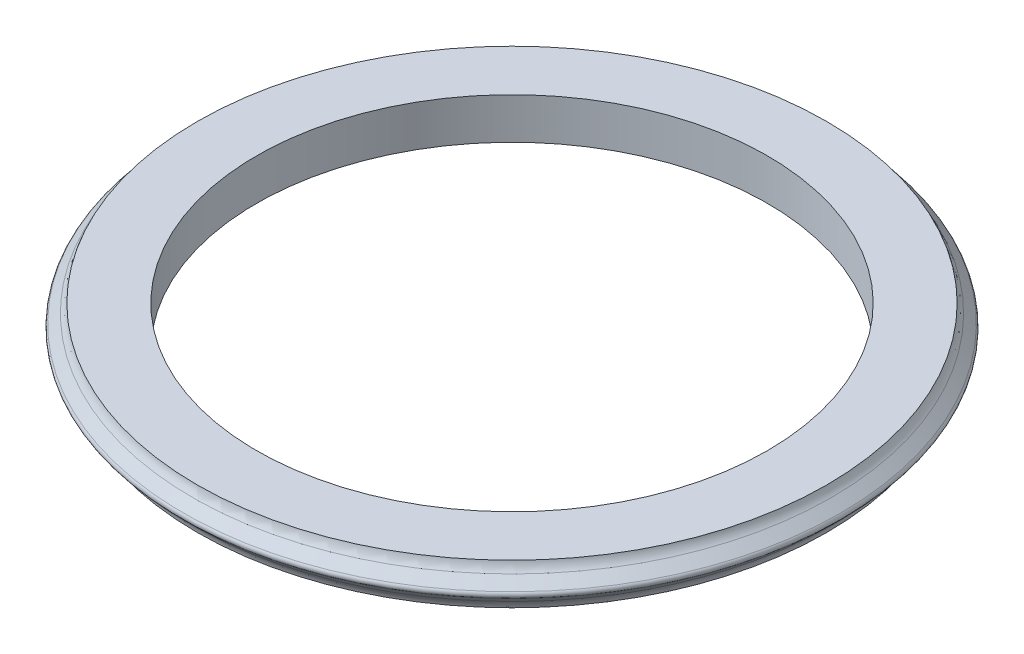
ISO-10303-21;
HEADER;
FILE_DESCRIPTION(('STEP AP214'),'2;1');
FILE_NAME('part.step','',(''),(''),'','','');
FILE_SCHEMA(('AUTOMOTIVE_DESIGN { 1 0 10303 214 1 1 1 1 }'));
ENDSEC;
DATA;
#1=APPLICATION_CONTEXT('core data for automotive mechanical design processes');
#2=APPLICATION_PROTOCOL_DEFINITION('international standard','automotive_design',2000,#1);
#3=PRODUCT_CONTEXT('',#1,'mechanical');
#4=PRODUCT('Part','Part','',(#3));
#5=PRODUCT_RELATED_PRODUCT_CATEGORY('part','',(#4));
#6=PRODUCT_DEFINITION_FORMATION('','',#4);
#7=PRODUCT_DEFINITION_CONTEXT('part definition',#1,'design');
#8=PRODUCT_DEFINITION('design','',#6,#7);
#9=PRODUCT_DEFINITION_SHAPE('','',#8);
#10=(LENGTH_UNIT() NAMED_UNIT(*) SI_UNIT(.MILLI.,.METRE.));
#11=(NAMED_UNIT(*) PLANE_ANGLE_UNIT() SI_UNIT($,.RADIAN.));
#12=(NAMED_UNIT(*) SI_UNIT($,.STERADIAN.) SOLID_ANGLE_UNIT());
#13=UNCERTAINTY_MEASURE_WITH_UNIT(LENGTH_MEASURE(1.E-05),#10,'distance_accuracy_value','');
#14=(GEOMETRIC_REPRESENTATION_CONTEXT(3) GLOBAL_UNCERTAINTY_ASSIGNED_CONTEXT((#13)) GLOBAL_UNIT_ASSIGNED_CONTEXT((#10,
#11,#12)) REPRESENTATION_CONTEXT('',''));
#15=CARTESIAN_POINT('',(0.,0.,0.));
#16=DIRECTION('',(0.,0.,1.));
#17=DIRECTION('',(1.,0.,0.));
#18=AXIS2_PLACEMENT_3D('',#15,#16,#17);
#19=CARTESIAN_POINT('',(19.1035533905933,0.,0.));
#20=DIRECTION('',(0.,-1.,0.));
#21=DIRECTION('',(1.,0.,0.));
#22=AXIS2_PLACEMENT_3D('',#19,#20,#21);
#23=PLANE('',#22);
#24=CARTESIAN_POINT('',(0.,0.,0.));
#25=DIRECTION('',(0.,-1.,0.));
#26=DIRECTION('',(1.,0.,0.));
#27=AXIS2_PLACEMENT_3D('',#24,#25,#26);
#28=CIRCLE('',#27,19.1035533905933);
#29=CARTESIAN_POINT('',(19.1035533905933,0.,0.));
#30=VERTEX_POINT('',#29);
#31=EDGE_CURVE('E45',#30,#30,#28,.T.);
#32=ORIENTED_EDGE('',*,*,#31,.T.);
#33=EDGE_LOOP('',(#32));
#34=FACE_BOUND('',#33,.T.);
#35=CARTESIAN_POINT('',(0.,0.,0.));
#36=DIRECTION('',(0.,-1.,0.));
#37=DIRECTION('',(1.,0.,0.));
#38=AXIS2_PLACEMENT_3D('',#35,#36,#37);
#39=CIRCLE('',#38,15.5);
#40=CARTESIAN_POINT('',(15.5,0.,0.));
#41=VERTEX_POINT('',#40);
#42=EDGE_CURVE('E63',#41,#41,#39,.T.);
#43=ORIENTED_EDGE('',*,*,#42,.F.);
#44=EDGE_LOOP('',(#43));
#45=FACE_BOUND('',#44,.T.);
#46=ADVANCED_FACE('F34',(#34,#45),#23,.T.);
#47=CARTESIAN_POINT('',(0.,0.249999999999991,0.));
#48=DIRECTION('',(0.,1.,0.));
#49=DIRECTION('',(-1.,0.,0.));
#50=AXIS2_PLACEMENT_3D('',#47,#48,#49);
#51=CONICAL_SURFACE('',#50,19.1035533905933,0.785398163397449);
#52=CARTESIAN_POINT('',(0.,0.526437037773792,0.));
#53=DIRECTION('',(0.,1.,0.));
#54=DIRECTION('',(-1.,0.,0.));
#55=AXIS2_PLACEMENT_3D('',#52,#53,#54);
#56=CIRCLE('',#55,19.3799904283671);
#57=CARTESIAN_POINT('',(-19.3799904283671,0.52643703777379,0.));
#58=VERTEX_POINT('',#57);
#59=EDGE_CURVE('E41',#58,#58,#56,.T.);
#60=ORIENTED_EDGE('',*,*,#59,.T.);
#61=EDGE_LOOP('',(#60));
#62=FACE_BOUND('',#61,.T.);
#63=CARTESIAN_POINT('',(0.,1.07322330470335,0.));
#64=DIRECTION('',(0.,-1.,0.));
#65=DIRECTION('',(1.,0.,0.));
#66=AXIS2_PLACEMENT_3D('',#63,#64,#65);
#67=CIRCLE('',#66,19.9267766952966);
#68=CARTESIAN_POINT('',(19.9267766952966,1.07322330470336,0.));
#69=VERTEX_POINT('',#68);
#70=EDGE_CURVE('E49',#69,#69,#67,.T.);
#71=ORIENTED_EDGE('',*,*,#70,.T.);
#72=EDGE_LOOP('',(#71));
#73=FACE_BOUND('',#72,.T.);
#74=ADVANCED_FACE('F71',(#62,#73),#51,.T.);
#75=CARTESIAN_POINT('',(0.,1.24999999999999,0.));
#76=DIRECTION('',(0.,-1.,0.));
#77=DIRECTION('',(1.,0.,0.));
#78=AXIS2_PLACEMENT_3D('',#75,#76,#77);
#79=TOROIDAL_SURFACE('',#78,19.75,0.25);
#80=CARTESIAN_POINT('',(0.,1.42677669529663,0.));
#81=DIRECTION('',(0.,-1.,0.));
#82=DIRECTION('',(1.,0.,0.));
#83=AXIS2_PLACEMENT_3D('',#80,#81,#82);
#84=CIRCLE('',#83,19.9267766952966);
#85=CARTESIAN_POINT('',(19.9267766952966,1.42677669529663,0.));
#86=VERTEX_POINT('',#85);
#87=EDGE_CURVE('E54',#86,#86,#84,.T.);
#88=ORIENTED_EDGE('',*,*,#87,.T.);
#89=EDGE_LOOP('',(#88));
#90=FACE_BOUND('',#89,.T.);
#91=ORIENTED_EDGE('',*,*,#70,.F.);
#92=EDGE_LOOP('',(#91));
#93=FACE_BOUND('',#92,.T.);
#94=ADVANCED_FACE('F77',(#90,#93),#79,.T.);
#95=CARTESIAN_POINT('',(0.,1.42677669529663,0.));
#96=DIRECTION('',(0.,-1.,0.));
#97=DIRECTION('',(1.,0.,0.));
#98=AXIS2_PLACEMENT_3D('',#95,#96,#97);
#99=CONICAL_SURFACE('',#98,19.9267766952966,0.785398163397449);
#100=CARTESIAN_POINT('',(0.,1.97356296222612,0.));
#101=DIRECTION('',(0.,-1.,0.));
#102=DIRECTION('',(1.,0.,0.));
#103=AXIS2_PLACEMENT_3D('',#100,#101,#102);
#104=CIRCLE('',#103,19.3799904283671);
#105=CARTESIAN_POINT('',(19.3799904283671,1.97356296222612,0.));
#106=VERTEX_POINT('',#105);
#107=EDGE_CURVE('E10',#106,#106,#104,.T.);
#108=ORIENTED_EDGE('',*,*,#107,.T.);
#109=EDGE_LOOP('',(#108));
#110=FACE_BOUND('',#109,.T.);
#111=ORIENTED_EDGE('',*,*,#87,.F.);
#112=EDGE_LOOP('',(#111));
#113=FACE_BOUND('',#112,.T.);
#114=ADVANCED_FACE('F95',(#110,#113),#99,.T.);
#115=CARTESIAN_POINT('',(15.5,2.49999999999999,0.));
#116=DIRECTION('',(0.,1.,0.));
#117=DIRECTION('',(-1.,0.,0.));
#118=AXIS2_PLACEMENT_3D('',#115,#116,#117);
#119=PLANE('',#118);
#120=CARTESIAN_POINT('',(0.,2.49999999999999,0.));
#121=DIRECTION('',(0.,-1.,0.));
#122=DIRECTION('',(1.,0.,0.));
#123=AXIS2_PLACEMENT_3D('',#120,#121,#122);
#124=CIRCLE('',#123,15.5);
#125=CARTESIAN_POINT('',(15.5,2.49999999999999,0.));
#126=VERTEX_POINT('',#125);
#127=EDGE_CURVE('E60',#126,#126,#124,.T.);
#128=ORIENTED_EDGE('',*,*,#127,.T.);
#129=EDGE_LOOP('',(#128));
#130=FACE_BOUND('',#129,.T.);
#131=CARTESIAN_POINT('',(0.,2.49999999999999,0.));
#132=DIRECTION('',(0.,-1.,0.));
#133=DIRECTION('',(1.,0.,0.));
#134=AXIS2_PLACEMENT_3D('',#131,#132,#133);
#135=CIRCLE('',#134,19.1035533905933);
#136=CARTESIAN_POINT('',(19.1035533905933,2.49999999999999,0.));
#137=VERTEX_POINT('',#136);
#138=EDGE_CURVE('E57',#137,#137,#135,.T.);
#139=ORIENTED_EDGE('',*,*,#138,.F.);
#140=EDGE_LOOP('',(#139));
#141=FACE_BOUND('',#140,.T.);
#142=ADVANCED_FACE('F88',(#130,#141),#119,.T.);
#143=CARTESIAN_POINT('',(0.,0.,0.));
#144=DIRECTION('',(0.,-1.,0.));
#145=DIRECTION('',(1.,0.,0.));
#146=AXIS2_PLACEMENT_3D('',#143,#144,#145);
#147=CYLINDRICAL_SURFACE('',#146,15.5);
#148=ORIENTED_EDGE('',*,*,#42,.T.);
#149=EDGE_LOOP('',(#148));
#150=FACE_BOUND('',#149,.T.);
#151=ORIENTED_EDGE('',*,*,#127,.F.);
#152=EDGE_LOOP('',(#151));
#153=FACE_BOUND('',#152,.T.);
#154=ADVANCED_FACE('F67',(#150,#153),#147,.F.);
#155=CARTESIAN_POINT('',(0.,-0.180669743412756,0.));
#156=DIRECTION('',(0.,-1.,0.));
#157=DIRECTION('',(1.,0.,0.));
#158=AXIS2_PLACEMENT_3D('',#155,#156,#157);
#159=TOROIDAL_SURFACE('',#158,20.0870972095536,1.);
#160=ORIENTED_EDGE('',*,*,#59,.F.);
#161=EDGE_LOOP('',(#160));
#162=FACE_BOUND('',#161,.T.);
#163=ORIENTED_EDGE('',*,*,#31,.F.);
#164=EDGE_LOOP('',(#163));
#165=FACE_BOUND('',#164,.T.);
#166=ADVANCED_FACE('F80',(#162,#165),#159,.F.);
#167=CARTESIAN_POINT('',(0.,2.68066974341267,0.));
#168=DIRECTION('',(0.,1.,0.));
#169=DIRECTION('',(-1.,0.,0.));
#170=AXIS2_PLACEMENT_3D('',#167,#168,#169);
#171=TOROIDAL_SURFACE('',#170,20.0870972095537,1.);
#172=ORIENTED_EDGE('',*,*,#138,.T.);
#173=EDGE_LOOP('',(#172));
#174=FACE_BOUND('',#173,.T.);
#175=ORIENTED_EDGE('',*,*,#107,.F.);
#176=EDGE_LOOP('',(#175));
#177=FACE_BOUND('',#176,.T.);
#178=ADVANCED_FACE('F36',(#174,#177),#171,.F.);
#179=CLOSED_SHELL('',(#46,#74,#94,#114,#142,#154,#166,#178));
#180=MANIFOLD_SOLID_BREP('B2',#179);
#181=ADVANCED_BREP_SHAPE_REPRESENTATION('',(#18,#180),#14);
#182=SHAPE_DEFINITION_REPRESENTATION(#9,#181);
ENDSEC;
END-ISO-10303-21;
